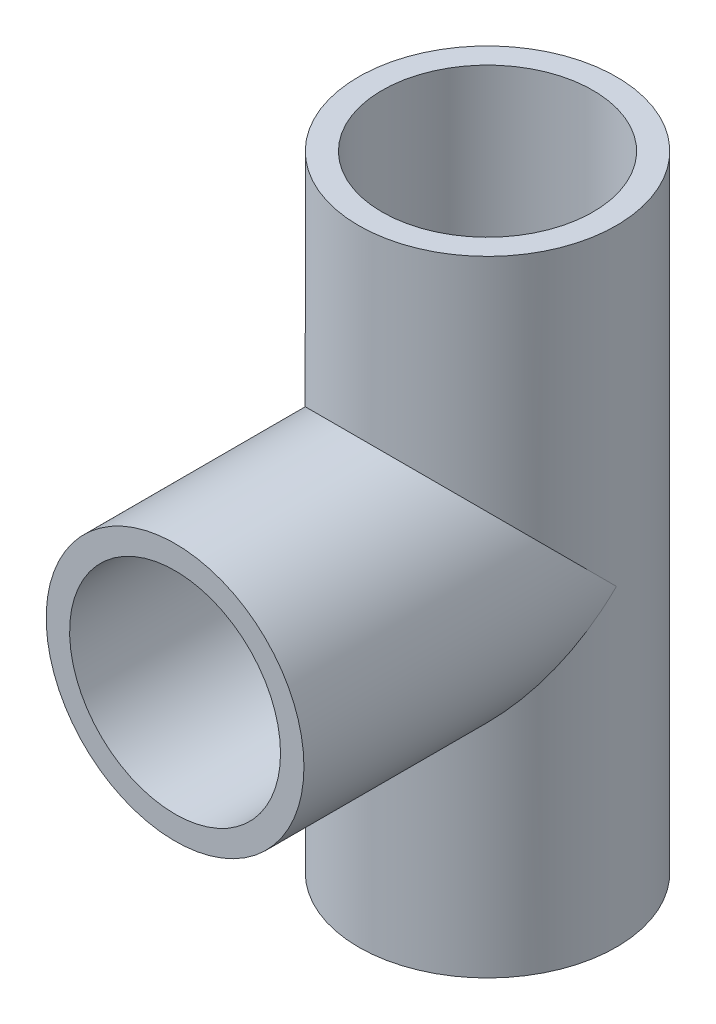
ISO-10303-21;
HEADER;
FILE_DESCRIPTION(('STEP AP214'),'2;1');
FILE_NAME('part.step','',(''),(''),'','','');
FILE_SCHEMA(('AUTOMOTIVE_DESIGN { 1 0 10303 214 1 1 1 1 }'));
ENDSEC;
DATA;
#1=APPLICATION_CONTEXT('core data for automotive mechanical design processes');
#2=APPLICATION_PROTOCOL_DEFINITION('international standard','automotive_design',2000,#1);
#3=PRODUCT_CONTEXT('',#1,'mechanical');
#4=PRODUCT('Part','Part','',(#3));
#5=PRODUCT_RELATED_PRODUCT_CATEGORY('part','',(#4));
#6=PRODUCT_DEFINITION_FORMATION('','',#4);
#7=PRODUCT_DEFINITION_CONTEXT('part definition',#1,'design');
#8=PRODUCT_DEFINITION('design','',#6,#7);
#9=PRODUCT_DEFINITION_SHAPE('','',#8);
#10=(LENGTH_UNIT() NAMED_UNIT(*) SI_UNIT(.MILLI.,.METRE.));
#11=(NAMED_UNIT(*) PLANE_ANGLE_UNIT() SI_UNIT($,.RADIAN.));
#12=(NAMED_UNIT(*) SI_UNIT($,.STERADIAN.) SOLID_ANGLE_UNIT());
#13=UNCERTAINTY_MEASURE_WITH_UNIT(LENGTH_MEASURE(1.E-05),#10,'distance_accuracy_value','');
#14=(GEOMETRIC_REPRESENTATION_CONTEXT(3) GLOBAL_UNCERTAINTY_ASSIGNED_CONTEXT((#13)) GLOBAL_UNIT_ASSIGNED_CONTEXT((#10,
#11,#12)) REPRESENTATION_CONTEXT('',''));
#15=CARTESIAN_POINT('',(0.,0.,0.));
#16=DIRECTION('',(0.,0.,1.));
#17=DIRECTION('',(1.,0.,0.));
#18=AXIS2_PLACEMENT_3D('',#15,#16,#17);
#19=CARTESIAN_POINT('',(0.,0.,0.));
#20=DIRECTION('',(0.,1.,0.));
#21=DIRECTION('',(0.,0.,1.));
#22=AXIS2_PLACEMENT_3D('',#19,#20,#21);
#23=CYLINDRICAL_SURFACE('',#22,16.5);
#24=CARTESIAN_POINT('',(0.,80.,0.));
#25=DIRECTION('',(0.,1.,0.));
#26=DIRECTION('',(0.,0.,1.));
#27=AXIS2_PLACEMENT_3D('',#24,#25,#26);
#28=CIRCLE('',#27,16.5);
#29=CARTESIAN_POINT('',(0.,80.,16.5));
#30=VERTEX_POINT('',#29);
#31=EDGE_CURVE('E109',#30,#30,#28,.T.);
#32=ORIENTED_EDGE('',*,*,#31,.F.);
#33=EDGE_LOOP('',(#32));
#34=FACE_BOUND('',#33,.T.);
#35=CARTESIAN_POINT('',(0.,0.,0.));
#36=DIRECTION('',(0.,1.,0.));
#37=DIRECTION('',(0.,0.,1.));
#38=AXIS2_PLACEMENT_3D('',#35,#36,#37);
#39=CIRCLE('',#38,16.5);
#40=CARTESIAN_POINT('',(0.,0.,16.5));
#41=VERTEX_POINT('',#40);
#42=EDGE_CURVE('E105',#41,#41,#39,.T.);
#43=ORIENTED_EDGE('',*,*,#42,.T.);
#44=EDGE_LOOP('',(#43));
#45=FACE_BOUND('',#44,.T.);
#46=CARTESIAN_POINT('',(0.,40.,0.));
#47=DIRECTION('',(0.,0.707106781186547,0.707106781186547));
#48=DIRECTION('',(0.,0.707106781186547,-0.707106781186547));
#49=AXIS2_PLACEMENT_3D('',#46,#47,#48);
#50=ELLIPSE('',#49,23.3345237791561,16.5);
#51=CARTESIAN_POINT('',(16.5,40.,0.));
#52=VERTEX_POINT('',#51);
#53=CARTESIAN_POINT('',(-16.5,40.,0.));
#54=VERTEX_POINT('',#53);
#55=EDGE_CURVE('E95',#52,#54,#50,.F.);
#56=ORIENTED_EDGE('',*,*,#55,.T.);
#57=CARTESIAN_POINT('',(0.,40.,0.));
#58=DIRECTION('',(0.,0.707106781186547,-0.707106781186547));
#59=DIRECTION('',(0.,0.707106781186547,0.707106781186547));
#60=AXIS2_PLACEMENT_3D('',#57,#58,#59);
#61=ELLIPSE('',#60,23.3345237791561,16.5);
#62=EDGE_CURVE('E99',#54,#52,#61,.T.);
#63=ORIENTED_EDGE('',*,*,#62,.T.);
#64=EDGE_LOOP('',(#56,#63));
#65=FACE_BOUND('',#64,.T.);
#66=ADVANCED_FACE('F45',(#34,#45,#65),#23,.T.);
#67=CARTESIAN_POINT('',(0.,0.,0.));
#68=DIRECTION('',(0.,1.,0.));
#69=DIRECTION('',(0.,0.,1.));
#70=AXIS2_PLACEMENT_3D('',#67,#68,#69);
#71=CYLINDRICAL_SURFACE('',#70,13.5);
#72=CARTESIAN_POINT('',(0.,80.,0.));
#73=DIRECTION('',(0.,1.,0.));
#74=DIRECTION('',(0.,0.,1.));
#75=AXIS2_PLACEMENT_3D('',#72,#73,#74);
#76=CIRCLE('',#75,13.5);
#77=CARTESIAN_POINT('',(0.,80.,13.5));
#78=VERTEX_POINT('',#77);
#79=EDGE_CURVE('E116',#78,#78,#76,.F.);
#80=ORIENTED_EDGE('',*,*,#79,.F.);
#81=EDGE_LOOP('',(#80));
#82=FACE_BOUND('',#81,.T.);
#83=CARTESIAN_POINT('',(0.,0.,0.));
#84=DIRECTION('',(0.,1.,0.));
#85=DIRECTION('',(0.,0.,1.));
#86=AXIS2_PLACEMENT_3D('',#83,#84,#85);
#87=CIRCLE('',#86,13.5);
#88=CARTESIAN_POINT('',(0.,0.,13.5));
#89=VERTEX_POINT('',#88);
#90=EDGE_CURVE('E112',#89,#89,#87,.F.);
#91=ORIENTED_EDGE('',*,*,#90,.T.);
#92=EDGE_LOOP('',(#91));
#93=FACE_BOUND('',#92,.T.);
#94=CARTESIAN_POINT('',(-13.5,30.5131670194949,0.));
#95=CARTESIAN_POINT('',(-13.5000021638284,30.5131746401855,0.124087917367418));
#96=CARTESIAN_POINT('',(-13.4982886251709,30.5107311993952,0.248156159749239));
#97=CARTESIAN_POINT('',(-13.4914546344185,30.5010156213692,0.49599354547566));
#98=CARTESIAN_POINT('',(-13.4863346308635,30.4937441198595,0.619762726045553));
#99=CARTESIAN_POINT('',(-13.4659286508322,30.4648358712868,0.989779249773456));
#100=CARTESIAN_POINT('',(-13.4455964886729,30.4361047778548,1.2352417919871));
#101=CARTESIAN_POINT('',(-13.3923457056594,30.3616854499865,1.71854713230876));
#102=CARTESIAN_POINT('',(-13.35960757638,30.3162406465158,1.95644851285648));
#103=CARTESIAN_POINT('',(-13.2821921746871,30.2103285819099,2.42698690415744));
#104=CARTESIAN_POINT('',(-13.2375086318469,30.1498534321702,2.65962108026433));
#105=CARTESIAN_POINT('',(-13.1179143562329,29.9908247284671,3.20549380356745));
#106=CARTESIAN_POINT('',(-13.0379625937989,29.8865190811439,3.51595347246484));
#107=CARTESIAN_POINT('',(-12.8585429475993,29.659361509393,4.12413820471579));
#108=CARTESIAN_POINT('',(-12.7590677063543,29.5365025971509,4.42185841548867));
#109=CARTESIAN_POINT('',(-12.541198406159,29.2763188251354,5.00663775034015));
#110=CARTESIAN_POINT('',(-12.4226689352299,29.1388930217896,5.29360093557335));
#111=CARTESIAN_POINT('',(-12.1682562472195,28.854598879947,5.85478005327838));
#112=CARTESIAN_POINT('',(-12.0323732108787,28.7077306398028,6.12899611847326));
#113=CARTESIAN_POINT('',(-11.6859105267532,28.3477725151962,6.77286572461673));
#114=CARTESIAN_POINT('',(-11.4672589438307,28.1317913122517,7.13658208013373));
#115=CARTESIAN_POINT('',(-10.9980751412778,27.6957292005709,7.8403590107121));
#116=CARTESIAN_POINT('',(-10.747530539603,27.4756467280501,8.18041031839772));
#117=CARTESIAN_POINT('',(-10.2155206481377,27.0380729378439,8.83577273647615));
#118=CARTESIAN_POINT('',(-9.93411906585938,26.8205772720481,9.15113259942887));
#119=CARTESIAN_POINT('',(-9.34018704695654,26.3932112769,9.75656752342829));
#120=CARTESIAN_POINT('',(-9.02766777569175,26.1833382490894,10.0466515841501));
#121=CARTESIAN_POINT('',(-8.43897428919781,25.8180429244619,10.5427671404784));
#122=CARTESIAN_POINT('',(-8.16848690528565,25.6602795001556,10.7538371295939));
#123=CARTESIAN_POINT('',(-7.60821434899069,25.3553161151326,11.1572490492237));
#124=CARTESIAN_POINT('',(-7.3184299744388,25.2081157182114,11.3495917532061));
#125=CARTESIAN_POINT('',(-6.72046308412562,24.9270306606792,11.7135711228468));
#126=CARTESIAN_POINT('',(-6.41230090821685,24.7931317006967,11.8852300672876));
#127=CARTESIAN_POINT('',(-5.7782984312312,24.5411009394474,12.2060398819899));
#128=CARTESIAN_POINT('',(-5.45246122616052,24.4229663893067,12.3551946769423));
#129=CARTESIAN_POINT('',(-4.84071471750938,24.2233418300785,12.6058586954801));
#130=CARTESIAN_POINT('',(-4.55727760475315,24.1390290566915,12.7111632032669));
#131=CARTESIAN_POINT('',(-3.98050962921239,23.9845503606376,12.9034066576875));
#132=CARTESIAN_POINT('',(-3.68718059941551,23.9143818336516,12.9903489854113));
#133=CARTESIAN_POINT('',(-3.09229769805653,23.7895088951491,13.1446596061456));
#134=CARTESIAN_POINT('',(-2.79074696660165,23.7347986679197,13.2120352607852));
#135=CARTESIAN_POINT('',(-2.18124626322261,23.641907762569,13.3262254833269));
#136=CARTESIAN_POINT('',(-1.87329621640919,23.6037272780046,13.373039810464));
#137=CARTESIAN_POINT('',(-1.25202549694399,23.5446005332162,13.4454680826836));
#138=CARTESIAN_POINT('',(-0.938688512888339,23.5237223623191,13.4709982712051));
#139=CARTESIAN_POINT('',(-0.310310042546883,23.4999224326476,13.5000974167442));
#140=CARTESIAN_POINT('',(0.00473144720533841,23.4970007104047,13.5036663290827));
#141=CARTESIAN_POINT('',(0.633937997369376,23.5091801510815,13.4887789351611));
#142=CARTESIAN_POINT('',(0.948103062465647,23.5242812174845,13.4703227468512));
#143=CARTESIAN_POINT('',(1.57302651897773,23.5721641776739,13.411714111128));
#144=CARTESIAN_POINT('',(1.88378500872794,23.6049455597206,13.3715622916736));
#145=CARTESIAN_POINT('',(2.4806309707964,23.6849301229601,13.2733666193786));
#146=CARTESIAN_POINT('',(2.76706178183255,23.7311243378795,13.2165725637708));
#147=CARTESIAN_POINT('',(3.33313607492585,23.8376008473917,13.0852826200077));
#148=CARTESIAN_POINT('',(3.61277989535328,23.8978824380492,13.010787616352));
#149=CARTESIAN_POINT('',(4.16383656240748,24.0315042769875,12.8450480203875));
#150=CARTESIAN_POINT('',(4.43524945496366,24.1048444523845,12.7538035215626));
#151=CARTESIAN_POINT('',(4.96876816922374,24.2634554266111,12.5555712740481));
#152=CARTESIAN_POINT('',(5.23087052937382,24.3487306057233,12.4485777445356));
#153=CARTESIAN_POINT('',(5.76802683205482,24.5381714440173,12.2095832684624));
#154=CARTESIAN_POINT('',(6.04210642481876,24.6433482449747,12.0761954897331));
#155=CARTESIAN_POINT('',(6.57724695935074,24.86481809099,11.7932812577103));
#156=CARTESIAN_POINT('',(6.83830248949452,24.9811156992671,11.6437481762102));
#157=CARTESIAN_POINT('',(7.34672767465209,25.2231644865942,11.3298218394455));
#158=CARTESIAN_POINT('',(7.59409666055202,25.3489161271293,11.1654278586876));
#159=CARTESIAN_POINT('',(8.07480855409087,25.6082636003897,10.8228737896824));
#160=CARTESIAN_POINT('',(8.30814951238881,25.7418605182227,10.6447117960512));
#161=CARTESIAN_POINT('',(8.80750794825335,26.0436526749939,10.2372885465465));
#162=CARTESIAN_POINT('',(9.07026991788762,26.2132784231182,10.0050913036123));
#163=CARTESIAN_POINT('',(9.57488979509109,26.5588311098509,9.5232987807895));
#164=CARTESIAN_POINT('',(9.81674445300387,26.7347590220256,9.27370080713018));
#165=CARTESIAN_POINT('',(10.2797725693711,27.0902528439051,8.75766086917118));
#166=CARTESIAN_POINT('',(10.5009169364315,27.2698234524062,8.49119606683328));
#167=CARTESIAN_POINT('',(10.922021737061,27.6292263941825,7.94223627678853));
#168=CARTESIAN_POINT('',(11.1219840565196,27.8090587027103,7.65974271960565));
#169=CARTESIAN_POINT('',(11.4929869480973,28.1583968379228,7.09028353243887));
#170=CARTESIAN_POINT('',(11.6648592397781,28.328029590066,6.80393797373973));
#171=CARTESIAN_POINT('',(11.9883966118805,28.6605930575903,6.21618059826845));
#172=CARTESIAN_POINT('',(12.1400578966811,28.8235225101335,5.91476596610367));
#173=CARTESIAN_POINT('',(12.422067321654,29.1378295076585,5.29692458189939));
#174=CARTESIAN_POINT('',(12.5524464377992,29.289223667742,4.98052052871885));
#175=CARTESIAN_POINT('',(12.7907457357203,29.5749628743725,4.33197702023832));
#176=CARTESIAN_POINT('',(12.8986791019794,29.7093179113862,3.99984694387002));
#177=CARTESIAN_POINT('',(13.058119473308,29.9130654214678,3.4337636008607));
#178=CARTESIAN_POINT('',(13.1164252264281,29.9891561509858,3.20412585081757));
#179=CARTESIAN_POINT('',(13.2215025529656,30.1283500342396,2.7383955260649));
#180=CARTESIAN_POINT('',(13.2682784029193,30.1914580019481,2.50230538080533));
#181=CARTESIAN_POINT('',(13.3494163614076,30.302175720113,2.02520232840163));
#182=CARTESIAN_POINT('',(13.3838175231472,30.3498341796795,1.78420748987141));
#183=CARTESIAN_POINT('',(13.4396762550741,30.4277783096888,1.2980289762919));
#184=CARTESIAN_POINT('',(13.4611424849487,30.4580756024302,1.05284821696841));
#185=CARTESIAN_POINT('',(13.4839022336048,30.4902912875641,0.672609323125134));
#186=CARTESIAN_POINT('',(13.4899311165372,30.4988508237527,0.53835772375549));
#187=CARTESIAN_POINT('',(13.4979830042865,30.5102963419857,0.269411695842707));
#188=CARTESIAN_POINT('',(13.5000035638023,30.5131788607245,0.134717047165492));
#189=CARTESIAN_POINT('',(13.5,30.5131670194949,0.));
#190=B_SPLINE_CURVE_WITH_KNOTS('',3,(#94,#95,#96,#97,#98,#99,#100,#101,#102,#103,#104,#105,#106,
#107,#108,#109,#110,#111,#112,#113,#114,#115,#116,#117,#118,#119,#120,#121,#122,#123,#124,#125,
#126,#127,#128,#129,#130,#131,#132,#133,#134,#135,#136,#137,#138,#139,#140,#141,#142,#143,#144,
#145,#146,#147,#148,#149,#150,#151,#152,#153,#154,#155,#156,#157,#158,#159,#160,#161,#162,#163,
#164,#165,#166,#167,#168,#169,#170,#171,#172,#173,#174,#175,#176,#177,#178,#179,#180,#181,#182,
#183,#184,#185,#186,#187,#188,#189),.UNSPECIFIED.,.F.,.F.,(4,2,2,2,2,2,2,2,2,2,2,2,2,2,2,2,2,2,
2,2,2,2,2,2,2,2,2,2,2,2,2,2,2,2,2,2,2,2,2,2,2,2,2,2,2,2,2,4),(0.,0.372189830805686,
0.744330663907449,1.48709990004565,2.21945365262969,2.95219259224372,3.96196551702797,
4.97211971087101,5.98979885313313,7.00746739694256,8.43414619621145,9.86138058375607,
11.2857218841906,12.7095539449042,13.8414392398083,14.9732777661213,16.103886062902,
17.234296954763,18.1750648534042,19.1156593739646,20.055899551955,20.9961507394966,
21.940084733879,22.8840206486429,23.8279515084021,24.7718550484678,25.6578088821317,
26.5437184548226,27.4296230831395,28.3158537053422,29.2822826512501,30.2491098692566,
31.2159843122537,32.1829928034647,33.3504911575775,34.5181706527378,35.6874665090234,
36.8566581723909,37.9795506252575,39.1026536607014,40.2241071676509,41.344900067984,
42.0908461127672,42.8365150622623,43.5798096750926,44.3226061120407,44.7264221870039,
45.1304845366664),.UNSPECIFIED.);
#191=CARTESIAN_POINT('',(-13.5,30.5131670194949,0.));
#192=VERTEX_POINT('',#191);
#193=CARTESIAN_POINT('',(13.5,30.5131670194949,0.));
#194=VERTEX_POINT('',#193);
#195=EDGE_CURVE('E50',#192,#194,#190,.T.);
#196=ORIENTED_EDGE('',*,*,#195,.T.);
#197=DIRECTION('',(0.,1.,0.));
#198=VECTOR('',#197,1.);
#199=CARTESIAN_POINT('',(13.5,0.,0.));
#200=LINE('',#199,#198);
#201=CARTESIAN_POINT('',(13.5,40.,0.));
#202=VERTEX_POINT('',#201);
#203=EDGE_CURVE('E62',#194,#202,#200,.T.);
#204=ORIENTED_EDGE('',*,*,#203,.T.);
#205=CARTESIAN_POINT('',(13.5,49.4868329805051,0.));
#206=VERTEX_POINT('',#205);
#207=EDGE_CURVE('E133',#202,#206,#200,.T.);
#208=ORIENTED_EDGE('',*,*,#207,.T.);
#209=CARTESIAN_POINT('',(13.5,49.4868329805051,0.));
#210=CARTESIAN_POINT('',(13.5000021638284,49.4868253598145,0.124087917367418));
#211=CARTESIAN_POINT('',(13.4982886251709,49.4892688006048,0.248156159749239));
#212=CARTESIAN_POINT('',(13.4914546344185,49.4989843786308,0.495993545475659));
#213=CARTESIAN_POINT('',(13.4863346308635,49.5062558801405,0.619762726045552));
#214=CARTESIAN_POINT('',(13.4659286508322,49.5351641287131,0.989779249773455));
#215=CARTESIAN_POINT('',(13.4455964886729,49.5638952221452,1.2352417919871));
#216=CARTESIAN_POINT('',(13.3923457056594,49.6383145500135,1.71854713230876));
#217=CARTESIAN_POINT('',(13.35960757638,49.6837593534842,1.95644851285647));
#218=CARTESIAN_POINT('',(13.2821921746871,49.7896714180901,2.42698690415743));
#219=CARTESIAN_POINT('',(13.2375086318469,49.8501465678298,2.65962108026433));
#220=CARTESIAN_POINT('',(13.1179143562329,50.0091752715329,3.20549380356745));
#221=CARTESIAN_POINT('',(13.0379625937989,50.1134809188561,3.51595347246484));
#222=CARTESIAN_POINT('',(12.8585429475993,50.340638490607,4.12413820471579));
#223=CARTESIAN_POINT('',(12.7590677063543,50.4634974028491,4.42185841548866));
#224=CARTESIAN_POINT('',(12.541198406159,50.7236811748646,5.00663775034015));
#225=CARTESIAN_POINT('',(12.4226689352299,50.8611069782104,5.29360093557335));
#226=CARTESIAN_POINT('',(12.1682562472195,51.145401120053,5.85478005327838));
#227=CARTESIAN_POINT('',(12.0323732108787,51.2922693601972,6.12899611847326));
#228=CARTESIAN_POINT('',(11.6859105267532,51.6522274848038,6.77286572461672));
#229=CARTESIAN_POINT('',(11.4672589438307,51.8682086877483,7.13658208013373));
#230=CARTESIAN_POINT('',(10.9980751412778,52.304270799429,7.84035901071209));
#231=CARTESIAN_POINT('',(10.747530539603,52.5243532719499,8.18041031839772));
#232=CARTESIAN_POINT('',(10.2155206481377,52.9619270621561,8.83577273647614));
#233=CARTESIAN_POINT('',(9.93411906585938,53.1794227279519,9.15113259942886));
#234=CARTESIAN_POINT('',(9.34018704695654,53.6067887231,9.75656752342828));
#235=CARTESIAN_POINT('',(9.02766777569176,53.8166617509106,10.0466515841501));
#236=CARTESIAN_POINT('',(8.43897428919782,54.1819570755381,10.5427671404784));
#237=CARTESIAN_POINT('',(8.16848690528566,54.3397204998444,10.7538371295939));
#238=CARTESIAN_POINT('',(7.60821434899069,54.6446838848674,11.1572490492237));
#239=CARTESIAN_POINT('',(7.3184299744388,54.7918842817886,11.3495917532061));
#240=CARTESIAN_POINT('',(6.72046308412563,55.0729693393208,11.7135711228468));
#241=CARTESIAN_POINT('',(6.41230090821686,55.2068682993033,11.8852300672876));
#242=CARTESIAN_POINT('',(5.77829843123121,55.4588990605526,12.2060398819899));
#243=CARTESIAN_POINT('',(5.45246122616053,55.5770336106933,12.3551946769423));
#244=CARTESIAN_POINT('',(4.84071471750939,55.7766581699215,12.6058586954801));
#245=CARTESIAN_POINT('',(4.55727760475316,55.8609709433085,12.7111632032669));
#246=CARTESIAN_POINT('',(3.9805096292124,56.0154496393624,12.9034066576875));
#247=CARTESIAN_POINT('',(3.68718059941552,56.0856181663484,12.9903489854113));
#248=CARTESIAN_POINT('',(3.09229769805654,56.2104911048509,13.1446596061456));
#249=CARTESIAN_POINT('',(2.79074696660166,56.2652013320803,13.2120352607851));
#250=CARTESIAN_POINT('',(2.18124626322262,56.358092237431,13.3262254833269));
#251=CARTESIAN_POINT('',(1.8732962164092,56.3962727219954,13.373039810464));
#252=CARTESIAN_POINT('',(1.252025496944,56.4553994667838,13.4454680826836));
#253=CARTESIAN_POINT('',(0.938688512888346,56.4762776376809,13.4709982712051));
#254=CARTESIAN_POINT('',(0.310310042546889,56.5000775673524,13.5000974167442));
#255=CARTESIAN_POINT('',(-0.00473144720533348,56.5029992895953,13.5036663290827));
#256=CARTESIAN_POINT('',(-0.633937997369372,56.4908198489185,13.4887789351611));
#257=CARTESIAN_POINT('',(-0.948103062465643,56.4757187825155,13.4703227468512));
#258=CARTESIAN_POINT('',(-1.57302651897773,56.4278358223262,13.411714111128));
#259=CARTESIAN_POINT('',(-1.88378500872794,56.3950544402794,13.3715622916736));
#260=CARTESIAN_POINT('',(-2.4806309707964,56.3150698770399,13.2733666193786));
#261=CARTESIAN_POINT('',(-2.76706178183254,56.2688756621205,13.2165725637708));
#262=CARTESIAN_POINT('',(-3.33313607492585,56.1623991526083,13.0852826200077));
#263=CARTESIAN_POINT('',(-3.61277989535327,56.1021175619508,13.010787616352));
#264=CARTESIAN_POINT('',(-4.16383656240748,55.9684957230125,12.8450480203875));
#265=CARTESIAN_POINT('',(-4.43524945496366,55.8951555476155,12.7538035215626));
#266=CARTESIAN_POINT('',(-4.96876816922373,55.7365445733889,12.5555712740481));
#267=CARTESIAN_POINT('',(-5.23087052937381,55.6512693942767,12.4485777445356));
#268=CARTESIAN_POINT('',(-5.76802683205482,55.4618285559827,12.2095832684624));
#269=CARTESIAN_POINT('',(-6.04210642481876,55.3566517550253,12.0761954897331));
#270=CARTESIAN_POINT('',(-6.57724695935074,55.13518190901,11.7932812577103));
#271=CARTESIAN_POINT('',(-6.83830248949451,55.0188843007329,11.6437481762102));
#272=CARTESIAN_POINT('',(-7.34672767465209,54.7768355134058,11.3298218394455));
#273=CARTESIAN_POINT('',(-7.59409666055202,54.6510838728707,11.1654278586876));
#274=CARTESIAN_POINT('',(-8.07480855409087,54.3917363996103,10.8228737896824));
#275=CARTESIAN_POINT('',(-8.3081495123888,54.2581394817773,10.6447117960512));
#276=CARTESIAN_POINT('',(-8.80750794825334,53.9563473250061,10.2372885465465));
#277=CARTESIAN_POINT('',(-9.07026991788761,53.7867215768818,10.0050913036123));
#278=CARTESIAN_POINT('',(-9.57488979509109,53.4411688901491,9.5232987807895));
#279=CARTESIAN_POINT('',(-9.81674445300387,53.2652409779744,9.27370080713018));
#280=CARTESIAN_POINT('',(-10.2797725693711,52.9097471560949,8.75766086917118));
#281=CARTESIAN_POINT('',(-10.5009169364315,52.7301765475938,8.49119606683328));
#282=CARTESIAN_POINT('',(-10.922021737061,52.3707736058175,7.94223627678853));
#283=CARTESIAN_POINT('',(-11.1219840565196,52.1909412972897,7.65974271960565));
#284=CARTESIAN_POINT('',(-11.4929869480973,51.8416031620772,7.09028353243887));
#285=CARTESIAN_POINT('',(-11.664859239778,51.671970409934,6.80393797373973));
#286=CARTESIAN_POINT('',(-11.9883966118805,51.3394069424097,6.21618059826845));
#287=CARTESIAN_POINT('',(-12.1400578966811,51.1764774898665,5.91476596610367));
#288=CARTESIAN_POINT('',(-12.422067321654,50.8621704923415,5.29692458189939));
#289=CARTESIAN_POINT('',(-12.5524464377992,50.710776332258,4.98052052871885));
#290=CARTESIAN_POINT('',(-12.7907457357203,50.4250371256275,4.33197702023832));
#291=CARTESIAN_POINT('',(-12.8986791019794,50.2906820886138,3.99984694387002));
#292=CARTESIAN_POINT('',(-13.058119473308,50.0869345785322,3.4337636008607));
#293=CARTESIAN_POINT('',(-13.1164252264281,50.0108438490142,3.20412585081757));
#294=CARTESIAN_POINT('',(-13.2215025529656,49.8716499657604,2.7383955260649));
#295=CARTESIAN_POINT('',(-13.2682784029193,49.8085419980519,2.50230538080533));
#296=CARTESIAN_POINT('',(-13.3494163614076,49.697824279887,2.02520232840163));
#297=CARTESIAN_POINT('',(-13.3838175231472,49.6501658203206,1.78420748987141));
#298=CARTESIAN_POINT('',(-13.4396762550741,49.5722216903112,1.2980289762919));
#299=CARTESIAN_POINT('',(-13.4611424849487,49.5419243975698,1.05284821696842));
#300=CARTESIAN_POINT('',(-13.4839022336048,49.5097087124359,0.672609323125136));
#301=CARTESIAN_POINT('',(-13.4899311165372,49.5011491762473,0.538357723755492));
#302=CARTESIAN_POINT('',(-13.4979830042865,49.4897036580143,0.269411695842708));
#303=CARTESIAN_POINT('',(-13.5000035638023,49.4868211392755,0.134717047165492));
#304=CARTESIAN_POINT('',(-13.5,49.4868329805051,0.));
#305=B_SPLINE_CURVE_WITH_KNOTS('',3,(#209,#210,#211,#212,#213,#214,#215,#216,#217,#218,#219,
#220,#221,#222,#223,#224,#225,#226,#227,#228,#229,#230,#231,#232,#233,#234,#235,#236,#237,#238,
#239,#240,#241,#242,#243,#244,#245,#246,#247,#248,#249,#250,#251,#252,#253,#254,#255,#256,#257,
#258,#259,#260,#261,#262,#263,#264,#265,#266,#267,#268,#269,#270,#271,#272,#273,#274,#275,#276,
#277,#278,#279,#280,#281,#282,#283,#284,#285,#286,#287,#288,#289,#290,#291,#292,#293,#294,#295,
#296,#297,#298,#299,#300,#301,#302,#303,#304),.UNSPECIFIED.,.F.,.F.,(4,2,2,2,2,2,2,2,2,2,2,2,2,
2,2,2,2,2,2,2,2,2,2,2,2,2,2,2,2,2,2,2,2,2,2,2,2,2,2,2,2,2,2,2,2,2,2,4),(0.,0.372189830805685,
0.744330663907447,1.48709990004565,2.21945365262969,2.95219259224372,3.96196551702797,
4.97211971087101,5.98979885313313,7.00746739694256,8.43414619621144,9.86138058375606,
11.2857218841906,12.7095539449042,13.8414392398083,14.9732777661213,16.103886062902,
17.234296954763,18.1750648534042,19.1156593739646,20.055899551955,20.9961507394966,
21.940084733879,22.8840206486429,23.8279515084021,24.7718550484678,25.6578088821317,
26.5437184548226,27.4296230831395,28.3158537053422,29.2822826512501,30.2491098692566,
31.2159843122537,32.1829928034647,33.3504911575775,34.5181706527378,35.6874665090234,
36.8566581723909,37.9795506252575,39.1026536607014,40.2241071676509,41.344900067984,
42.0908461127672,42.8365150622623,43.5798096750926,44.3226061120407,44.7264221870039,
45.1304845366664),.UNSPECIFIED.);
#306=CARTESIAN_POINT('',(-13.5,49.4868329805051,0.));
#307=VERTEX_POINT('',#306);
#308=EDGE_CURVE('E136',#206,#307,#305,.T.);
#309=ORIENTED_EDGE('',*,*,#308,.T.);
#310=DIRECTION('',(0.,1.,0.));
#311=VECTOR('',#310,1.);
#312=CARTESIAN_POINT('',(-13.5,0.,0.));
#313=LINE('',#312,#311);
#314=CARTESIAN_POINT('',(-13.5,40.,0.));
#315=VERTEX_POINT('',#314);
#316=EDGE_CURVE('E134',#307,#315,#313,.F.);
#317=ORIENTED_EDGE('',*,*,#316,.T.);
#318=EDGE_CURVE('E130',#315,#192,#313,.F.);
#319=ORIENTED_EDGE('',*,*,#318,.T.);
#320=EDGE_LOOP('',(#196,#204,#208,#309,#317,#319));
#321=FACE_BOUND('',#320,.T.);
#322=ADVANCED_FACE('F198',(#82,#93,#321),#71,.F.);
#323=CARTESIAN_POINT('',(0.,0.,0.));
#324=DIRECTION('',(0.,1.,0.));
#325=DIRECTION('',(0.,0.,1.));
#326=AXIS2_PLACEMENT_3D('',#323,#324,#325);
#327=PLANE('',#326);
#328=ORIENTED_EDGE('',*,*,#90,.F.);
#329=EDGE_LOOP('',(#328));
#330=FACE_BOUND('',#329,.T.);
#331=ORIENTED_EDGE('',*,*,#42,.F.);
#332=EDGE_LOOP('',(#331));
#333=FACE_BOUND('',#332,.T.);
#334=ADVANCED_FACE('F167',(#330,#333),#327,.F.);
#335=CARTESIAN_POINT('',(0.,80.,0.));
#336=DIRECTION('',(0.,1.,0.));
#337=DIRECTION('',(0.,0.,1.));
#338=AXIS2_PLACEMENT_3D('',#335,#336,#337);
#339=PLANE('',#338);
#340=ORIENTED_EDGE('',*,*,#79,.T.);
#341=EDGE_LOOP('',(#340));
#342=FACE_BOUND('',#341,.T.);
#343=ORIENTED_EDGE('',*,*,#31,.T.);
#344=EDGE_LOOP('',(#343));
#345=FACE_BOUND('',#344,.T.);
#346=ADVANCED_FACE('F166',(#342,#345),#339,.T.);
#347=CARTESIAN_POINT('',(0.,40.,40.));
#348=DIRECTION('',(0.,0.,-1.));
#349=DIRECTION('',(-1.,0.,0.));
#350=AXIS2_PLACEMENT_3D('',#347,#348,#349);
#351=CYLINDRICAL_SURFACE('',#350,13.5);
#352=CARTESIAN_POINT('',(0.,40.,0.));
#353=DIRECTION('',(0.,0.,1.));
#354=DIRECTION('',(1.,0.,0.));
#355=AXIS2_PLACEMENT_3D('',#352,#353,#354);
#356=CIRCLE('',#355,13.5);
#357=EDGE_CURVE('E76',#315,#202,#356,.T.);
#358=ORIENTED_EDGE('',*,*,#357,.F.);
#359=CARTESIAN_POINT('',(0.,40.,0.));
#360=DIRECTION('',(0.,0.707106781186547,0.707106781186547));
#361=DIRECTION('',(0.,0.707106781186547,-0.707106781186547));
#362=AXIS2_PLACEMENT_3D('',#359,#360,#361);
#363=ELLIPSE('',#362,19.0918830920368,13.5);
#364=EDGE_CURVE('E120',#315,#202,#363,.T.);
#365=ORIENTED_EDGE('',*,*,#364,.T.);
#366=EDGE_LOOP('',(#358,#365));
#367=FACE_BOUND('',#366,.T.);
#368=ADVANCED_FACE('F163',(#367),#351,.F.);
#369=CARTESIAN_POINT('',(0.,40.,40.));
#370=DIRECTION('',(0.,0.,-1.));
#371=DIRECTION('',(-1.,0.,0.));
#372=AXIS2_PLACEMENT_3D('',#369,#370,#371);
#373=CYLINDRICAL_SURFACE('',#372,16.5);
#374=ORIENTED_EDGE('',*,*,#195,.F.);
#375=CARTESIAN_POINT('',(0.,40.,0.));
#376=DIRECTION('',(0.,0.,1.));
#377=DIRECTION('',(1.,0.,0.));
#378=AXIS2_PLACEMENT_3D('',#375,#376,#377);
#379=CIRCLE('',#378,16.5);
#380=EDGE_CURVE('E172',#192,#194,#379,.T.);
#381=ORIENTED_EDGE('',*,*,#380,.T.);
#382=EDGE_LOOP('',(#374,#381));
#383=FACE_BOUND('',#382,.T.);
#384=ADVANCED_FACE('F151',(#383),#373,.T.);
#385=CARTESIAN_POINT('',(0.,40.,0.));
#386=DIRECTION('',(0.,0.,1.));
#387=DIRECTION('',(1.,0.,0.));
#388=AXIS2_PLACEMENT_3D('',#385,#386,#387);
#389=PLANE('',#388);
#390=ORIENTED_EDGE('',*,*,#203,.F.);
#391=ORIENTED_EDGE('',*,*,#380,.F.);
#392=ORIENTED_EDGE('',*,*,#318,.F.);
#393=ORIENTED_EDGE('',*,*,#357,.T.);
#394=EDGE_LOOP('',(#390,#391,#392,#393));
#395=FACE_BOUND('',#394,.T.);
#396=ADVANCED_FACE('F157',(#395),#389,.F.);
#397=CARTESIAN_POINT('',(0.,40.,0.));
#398=DIRECTION('',(0.,0.707106781186547,-0.707106781186547));
#399=DIRECTION('',(0.,0.707106781186547,0.707106781186547));
#400=AXIS2_PLACEMENT_3D('',#397,#398,#399);
#401=ELLIPSE('',#400,19.0918830920368,13.5);
#402=EDGE_CURVE('E126',#202,#315,#401,.F.);
#403=ORIENTED_EDGE('',*,*,#402,.F.);
#404=ORIENTED_EDGE('',*,*,#364,.F.);
#405=EDGE_LOOP('',(#403,#404));
#406=FACE_BOUND('',#405,.T.);
#407=ADVANCED_FACE('F142',(#406),#71,.F.);
#408=ORIENTED_EDGE('',*,*,#308,.F.);
#409=EDGE_CURVE('E176',#206,#307,#379,.T.);
#410=ORIENTED_EDGE('',*,*,#409,.T.);
#411=EDGE_LOOP('',(#408,#410));
#412=FACE_BOUND('',#411,.T.);
#413=ADVANCED_FACE('F145',(#412),#373,.T.);
#414=EDGE_CURVE('E181',#202,#315,#356,.T.);
#415=ORIENTED_EDGE('',*,*,#414,.F.);
#416=ORIENTED_EDGE('',*,*,#402,.T.);
#417=EDGE_LOOP('',(#415,#416));
#418=FACE_BOUND('',#417,.T.);
#419=ADVANCED_FACE('F149',(#418),#351,.F.);
#420=ORIENTED_EDGE('',*,*,#207,.F.);
#421=ORIENTED_EDGE('',*,*,#414,.T.);
#422=ORIENTED_EDGE('',*,*,#316,.F.);
#423=ORIENTED_EDGE('',*,*,#409,.F.);
#424=EDGE_LOOP('',(#420,#421,#422,#423));
#425=FACE_BOUND('',#424,.T.);
#426=ADVANCED_FACE('F152',(#425),#389,.F.);
#427=ORIENTED_EDGE('',*,*,#62,.F.);
#428=ORIENTED_EDGE('',*,*,#55,.F.);
#429=EDGE_LOOP('',(#427,#428));
#430=FACE_BOUND('',#429,.T.);
#431=CARTESIAN_POINT('',(0.,40.,40.));
#432=DIRECTION('',(0.,0.,1.));
#433=DIRECTION('',(1.,0.,0.));
#434=AXIS2_PLACEMENT_3D('',#431,#432,#433);
#435=CIRCLE('',#434,16.5);
#436=CARTESIAN_POINT('',(16.5,40.,40.));
#437=VERTEX_POINT('',#436);
#438=EDGE_CURVE('E102',#437,#437,#435,.T.);
#439=ORIENTED_EDGE('',*,*,#438,.F.);
#440=EDGE_LOOP('',(#439));
#441=FACE_BOUND('',#440,.T.);
#442=ADVANCED_FACE('F97',(#430,#441),#373,.T.);
#443=CARTESIAN_POINT('',(0.,26.5,16.5));
#444=CARTESIAN_POINT('',(-0.322137405298703,26.5000018559313,16.4999981857799));
#445=CARTESIAN_POINT('',(-0.644304929519497,26.5115503032647,16.4905456710231));
#446=CARTESIAN_POINT('',(-1.28603387161959,26.5575419481087,16.4529482567365));
#447=CARTESIAN_POINT('',(-1.6055939480376,26.5919962603247,16.4247942826276));
#448=CARTESIAN_POINT('',(-2.23993485078914,26.6832603623407,16.3503778539733));
#449=CARTESIAN_POINT('',(-2.55470625533269,26.7401094680176,16.304083553374));
#450=CARTESIAN_POINT('',(-3.17653185252034,26.8751807600559,16.1944227161219));
#451=CARTESIAN_POINT('',(-3.48358681178679,26.9534008139916,16.1310578828014));
#452=CARTESIAN_POINT('',(-4.08610468869648,27.1294277638281,15.9890257783106));
#453=CARTESIAN_POINT('',(-4.38162964491563,27.2271049512279,15.9104599373105));
#454=CARTESIAN_POINT('',(-4.96163447863255,27.4410294341357,15.7392385686471));
#455=CARTESIAN_POINT('',(-5.24611432063776,27.5572767893112,15.6465829957123));
#456=CARTESIAN_POINT('',(-5.80281852848309,27.8069548463472,15.4487716885914));
#457=CARTESIAN_POINT('',(-6.07504536551632,27.940382062217,15.343618490649));
#458=CARTESIAN_POINT('',(-6.60651946898896,28.2231351149629,15.1223939390182));
#459=CARTESIAN_POINT('',(-6.8657640069955,28.3724642734344,15.0063203048631));
#460=CARTESIAN_POINT('',(-7.46137578742272,28.7420721884281,14.7214971868291));
#461=CARTESIAN_POINT('',(-7.79201331825659,28.9685744734181,14.5487981843906));
#462=CARTESIAN_POINT('',(-8.42747020888247,29.4460519096869,14.190171076317));
#463=CARTESIAN_POINT('',(-8.73228096035575,29.6970351612173,14.0042385975334));
#464=CARTESIAN_POINT('',(-9.31645607535724,30.222051201484,13.6226159488179));
#465=CARTESIAN_POINT('',(-9.59575176504798,30.4961425863957,13.426901518648));
#466=CARTESIAN_POINT('',(-10.12783917489,31.0653119061484,13.0302328773096));
#467=CARTESIAN_POINT('',(-10.3806340963739,31.3603872988449,12.8292793027083));
#468=CARTESIAN_POINT('',(-10.8637530387456,31.9759978297547,12.4229689703065));
#469=CARTESIAN_POINT('',(-11.0936175248574,32.2968827187988,12.2175957873926));
#470=CARTESIAN_POINT('',(-11.5255610789639,32.9595505714265,11.8109863459469));
#471=CARTESIAN_POINT('',(-11.7276309879677,33.3013403703438,11.6097514695779));
#472=CARTESIAN_POINT('',(-12.1025542608818,34.0052648216187,11.2183512031701));
#473=CARTESIAN_POINT('',(-12.2754815922713,34.3673447610702,11.0281586169091));
#474=CARTESIAN_POINT('',(-12.5910261766779,35.1133020419184,10.6664672513735));
#475=CARTESIAN_POINT('',(-12.7336695276203,35.4971602508484,10.4949524386966));
#476=CARTESIAN_POINT('',(-12.9303973378702,36.1130212080574,10.2502491543481));
#477=CARTESIAN_POINT('',(-12.9958184511022,36.337457522771,10.167021575558));
#478=CARTESIAN_POINT('',(-13.1157052412933,36.7931661983749,10.0118864837505));
#479=CARTESIAN_POINT('',(-13.1701695341117,37.0244394187227,9.93998040119116));
#480=CARTESIAN_POINT('',(-13.2672874918559,37.492781513867,9.80997823113285));
#481=CARTESIAN_POINT('',(-13.3099649350719,37.7298376546484,9.75185437398507));
#482=CARTESIAN_POINT('',(-13.3828763748756,38.2091005578603,9.65155313216973));
#483=CARTESIAN_POINT('',(-13.413116795661,38.4513045930373,9.60936751570989));
#484=CARTESIAN_POINT('',(-13.4607736677785,38.9421616564007,9.54249954798148));
#485=CARTESIAN_POINT('',(-13.478044655098,39.1908563776568,9.51801584992607));
#486=CARTESIAN_POINT('',(-13.4987502459349,39.6899756860257,9.48862869868158));
#487=CARTESIAN_POINT('',(-13.5021858204876,39.9404001505011,9.48372387135391));
#488=CARTESIAN_POINT('',(-13.4951237628758,40.4407497815398,9.49377004269708));
#489=CARTESIAN_POINT('',(-13.4846204765308,40.6906747042739,9.50872909898474));
#490=CARTESIAN_POINT('',(-13.449962304972,41.1876890505344,9.55768772372261));
#491=CARTESIAN_POINT('',(-13.4258055926424,41.4347780900436,9.5916898405297));
#492=CARTESIAN_POINT('',(-13.3607446517925,41.9536734366041,9.68214641488135));
#493=CARTESIAN_POINT('',(-13.3181772689574,42.2248835945379,9.74080723134431));
#494=CARTESIAN_POINT('',(-13.2177276882821,42.7596673505229,9.87667854276626));
#495=CARTESIAN_POINT('',(-13.1598426069233,43.0232395003622,9.9538925300614));
#496=CARTESIAN_POINT('',(-13.0296910888406,43.5424535576759,10.1236652088585));
#497=CARTESIAN_POINT('',(-12.9573889316408,43.7980739076203,10.2162619163275));
#498=CARTESIAN_POINT('',(-12.79943769761,44.3004371906265,10.4134710438506));
#499=CARTESIAN_POINT('',(-12.7137836093732,44.5471767474672,10.5180879715849));
#500=CARTESIAN_POINT('',(-12.4797119922881,45.1640461813848,10.7960798707033));
#501=CARTESIAN_POINT('',(-12.3225559441467,45.5280116912502,10.9758154575779));
#502=CARTESIAN_POINT('',(-11.9801629243665,46.2354000447551,11.3485626014283));
#503=CARTESIAN_POINT('',(-11.7949111125247,46.5788118974498,11.5415811448643));
#504=CARTESIAN_POINT('',(-11.3971868605923,47.2460422336109,11.9345043845463));
#505=CARTESIAN_POINT('',(-11.1846798667283,47.5698350635243,12.1344175823838));
#506=CARTESIAN_POINT('',(-10.7332024178589,48.1974232959566,12.535532481895));
#507=CARTESIAN_POINT('',(-10.4942368266554,48.5012223575508,12.7367339403658));
#508=CARTESIAN_POINT('',(-9.98014287462606,49.099914061262,13.1437593837925));
#509=CARTESIAN_POINT('',(-9.70396633576226,49.3939948580279,13.3494567986937));
#510=CARTESIAN_POINT('',(-9.12326612918153,49.9589201085682,13.7528552378942));
#511=CARTESIAN_POINT('',(-8.81873819131716,50.2297610502275,13.9505550511809));
#512=CARTESIAN_POINT('',(-8.18227641768607,50.7455936091691,14.3331063598018));
#513=CARTESIAN_POINT('',(-7.85040171293251,50.9906385186064,14.5179840634587));
#514=CARTESIAN_POINT('',(-7.15938595947616,51.452763053913,14.8708960467226));
#515=CARTESIAN_POINT('',(-6.8002559647975,51.6698539218821,15.0389370913511));
#516=CARTESIAN_POINT('',(-6.15685707703319,52.0182510216742,15.3111062891803));
#517=CARTESIAN_POINT('',(-5.87863454911434,52.1568724541428,15.4202230535926));
#518=CARTESIAN_POINT('',(-5.30929856814279,52.4160832611869,15.6253910100835));
#519=CARTESIAN_POINT('',(-5.0181882930604,52.5366770494234,15.7214453996675));
#520=CARTESIAN_POINT('',(-4.42438759123007,52.7583374930715,15.8987658693414));
#521=CARTESIAN_POINT('',(-4.12170229932642,52.8594126895384,15.9800384168437));
#522=CARTESIAN_POINT('',(-3.50625366888651,53.0406700853596,16.1262582825042));
#523=CARTESIAN_POINT('',(-3.19349011741412,53.1208518429462,16.1912052554758));
#524=CARTESIAN_POINT('',(-2.55788521273931,53.2594757909113,16.3037433669835));
#525=CARTESIAN_POINT('',(-2.23499142975609,53.3177727615537,16.3512185292748));
#526=CARTESIAN_POINT('',(-1.58359684315764,53.4108333300875,16.4271033253012));
#527=CARTESIAN_POINT('',(-1.25509604038667,53.4455969315224,16.455512961907));
#528=CARTESIAN_POINT('',(-0.595414454133803,53.490913810544,16.4925615035171));
#529=CARTESIAN_POINT('',(-0.26423453021228,53.5014745664791,16.5012065155182));
#530=CARTESIAN_POINT('',(0.397907804616143,53.498194532583,16.4985227479038));
#531=CARTESIAN_POINT('',(0.728870230372064,53.4843556310061,16.4871955139116));
#532=CARTESIAN_POINT('',(1.35433463494431,53.4351792863735,16.4470018534158));
#533=CARTESIAN_POINT('',(1.64914479626164,53.4021529069562,16.4200212431624));
#534=CARTESIAN_POINT('',(2.23415634756876,53.3171280008094,16.3506969703319));
#535=CARTESIAN_POINT('',(2.52435810918735,53.2651310120914,16.30835455319));
#536=CARTESIAN_POINT('',(3.09837132641127,53.1429153697993,16.2091009701053));
#537=CARTESIAN_POINT('',(3.38218213017908,53.0726948666076,16.1521883253476));
#538=CARTESIAN_POINT('',(3.94183722061654,52.9149702949795,16.0248025307115));
#539=CARTESIAN_POINT('',(4.21768106552006,52.8274652702213,15.9543286305184));
#540=CARTESIAN_POINT('',(4.77039720539248,52.6325930199744,15.7980659777738));
#541=CARTESIAN_POINT('',(5.04691223636475,52.5245986985942,15.711798013006));
#542=CARTESIAN_POINT('',(5.58885442817615,52.2923404248645,15.5272875603168));
#543=CARTESIAN_POINT('',(5.85428163211334,52.1680765357621,15.4290451189456));
#544=CARTESIAN_POINT('',(6.37326104976856,51.9044638369531,15.2220103279799));
#545=CARTESIAN_POINT('',(6.62681258580346,51.7651141678777,15.1132173774074));
#546=CARTESIAN_POINT('',(7.12149474876503,51.4724426194717,14.886516712212));
#547=CARTESIAN_POINT('',(7.36262291394989,51.3191179874854,14.7686072025927));
#548=CARTESIAN_POINT('',(7.93811699665376,50.9273154793228,14.4700928291289));
#549=CARTESIAN_POINT('',(8.26541287705877,50.6816517778231,14.2852214791777));
#550=CARTESIAN_POINT('',(8.89246070048407,50.1655872332577,13.903559522569));
#551=CARTESIAN_POINT('',(9.19220194282874,49.8951768606406,13.7067643341717));
#552=CARTESIAN_POINT('',(9.76492272821987,49.3305201751133,13.3048521602885));
#553=CARTESIAN_POINT('',(10.0377981628341,49.0361886282946,13.0997068448369));
#554=CARTESIAN_POINT('',(10.5553590924758,48.4258236914212,12.6863722342922));
#555=CARTESIAN_POINT('',(10.8000488671439,48.10979360768,12.4781834067425));
#556=CARTESIAN_POINT('',(11.2649315461091,47.4509482109348,12.060289748867));
#557=CARTESIAN_POINT('',(11.4846434985431,47.107771932879,11.8506182664008));
#558=CARTESIAN_POINT('',(11.8941594057897,46.398951385273,11.4395422037143));
#559=CARTESIAN_POINT('',(12.0839489297915,46.0332963922568,11.2381416467618));
#560=CARTESIAN_POINT('',(12.4312341691592,45.2806684572836,10.8527116528913));
#561=CARTESIAN_POINT('',(12.588877910533,44.8938041421393,10.6686047986911));
#562=CARTESIAN_POINT('',(12.870315771567,44.0967163182166,10.3273342639633));
#563=CARTESIAN_POINT('',(12.9941549365666,43.6865247834523,10.1701348339733));
#564=CARTESIAN_POINT('',(13.1537433530553,43.0462993096861,9.96178461633989));
#565=CARTESIAN_POINT('',(13.2032296841533,42.8243916605334,9.8959689425885));
#566=CARTESIAN_POINT('',(13.2914114098345,42.3750307412683,9.77721059987736));
#567=CARTESIAN_POINT('',(13.3301086189672,42.1475784106842,9.72426576645006));
#568=CARTESIAN_POINT('',(13.3959854967,41.6885516210265,9.63331396996415));
#569=CARTESIAN_POINT('',(13.4231898934453,41.4569871408073,9.5952749482063));
#570=CARTESIAN_POINT('',(13.4656392554033,40.9906376271781,9.53561282607227));
#571=CARTESIAN_POINT('',(13.4808843626009,40.7558526320367,9.51398953080276));
#572=CARTESIAN_POINT('',(13.4991040825026,40.2834862037223,9.48812149959798));
#573=CARTESIAN_POINT('',(13.5020079665337,40.045896456337,9.48397693690641));
#574=CARTESIAN_POINT('',(13.4952777443993,39.5712664475791,9.49355094050203));
#575=CARTESIAN_POINT('',(13.4856438509511,39.3342261769524,9.50726920372661));
#576=CARTESIAN_POINT('',(13.4540558444035,38.8622826366956,9.55191704055625));
#577=CARTESIAN_POINT('',(13.4320842558666,38.6273828796096,9.58287102677196));
#578=CARTESIAN_POINT('',(13.3763042874157,38.1616509536548,9.66057730563972));
#579=CARTESIAN_POINT('',(13.3424940234917,37.9308194383518,9.70733211279748));
#580=CARTESIAN_POINT('',(13.2522982577341,37.4085500929416,9.83025704496465));
#581=CARTESIAN_POINT('',(13.1922142422446,37.118831976724,9.91102171233957));
#582=CARTESIAN_POINT('',(13.0548634592841,36.5494295382937,10.0912509613043));
#583=CARTESIAN_POINT('',(12.9775873289835,36.2697507802726,10.1907257278382));
#584=CARTESIAN_POINT('',(12.8069332925129,35.7203492922574,10.4043828261617));
#585=CARTESIAN_POINT('',(12.7135163640238,35.4506526598281,10.5186006276874));
#586=CARTESIAN_POINT('',(12.5117275236715,34.9219348732609,10.757843408348));
#587=CARTESIAN_POINT('',(12.4033551506221,34.6629140486565,10.8828687207133));
#588=CARTESIAN_POINT('',(12.1138532521521,34.026625070049,11.205908394281));
#589=CARTESIAN_POINT('',(11.9236785208651,33.6559307756676,11.4088113477174));
#590=CARTESIAN_POINT('',(11.5125487719446,32.9372332701219,11.8235637013891));
#591=CARTESIAN_POINT('',(11.2915797769836,32.5892404689223,12.0354171335919));
#592=CARTESIAN_POINT('',(10.8193631911233,31.9153988979125,12.4616480215246));
#593=CARTESIAN_POINT('',(10.5680840265316,31.5895737820135,12.676027895639));
#594=CARTESIAN_POINT('',(10.0357544733264,30.96101823122,13.1015173536221));
#595=CARTESIAN_POINT('',(9.7547093057565,30.6582837621302,13.3126275035882));
#596=CARTESIAN_POINT('',(9.15793192603612,30.0722572589002,13.7301541374449));
#597=CARTESIAN_POINT('',(8.84169589620956,29.789377767936,13.9364319983228));
#598=CARTESIAN_POINT('',(8.17868155648937,29.2509764489873,14.3355815730119));
#599=CARTESIAN_POINT('',(7.83189772399008,28.995459586351,14.5284508514202));
#600=CARTESIAN_POINT('',(7.1095069214219,28.515555809826,14.8952543576798));
#601=CARTESIAN_POINT('',(6.73397703707688,28.2910898787288,15.0692363965128));
#602=CARTESIAN_POINT('',(5.95499944616183,27.8763719402113,15.3936898605919));
#603=CARTESIAN_POINT('',(5.5515699120476,27.6860979471685,15.5441763853709));
#604=CARTESIAN_POINT('',(4.86023322221512,27.4017095376016,15.7706137244925));
#605=CARTESIAN_POINT('',(4.57932302668411,27.2968213798968,15.8545733562104));
#606=CARTESIAN_POINT('',(4.0076846451315,27.1050673762194,16.0086232702409));
#607=CARTESIAN_POINT('',(3.71695731610195,27.0181999618211,16.0787147595354));
#608=CARTESIAN_POINT('',(3.1278736206643,26.8638313223306,16.2036068705108));
#609=CARTESIAN_POINT('',(2.82953495757994,26.7962889534568,16.2584399709658));
#610=CARTESIAN_POINT('',(2.22660048617368,26.6813526594194,16.3519187271215));
#611=CARTESIAN_POINT('',(1.92200727025945,26.6339505563727,16.3905709529146));
#612=CARTESIAN_POINT('',(1.34827334026585,26.5648022667782,16.4470118019448));
#613=CARTESIAN_POINT('',(1.07963505720706,26.5405330890863,16.466850399868));
#614=CARTESIAN_POINT('',(0.540671854390159,26.5081291793736,16.4933468920246));
#615=CARTESIAN_POINT('',(0.270346533612811,26.4999984424517,16.5000015225432));
#616=CARTESIAN_POINT('',(0.,26.5,16.5));
#617=B_SPLINE_CURVE_WITH_KNOTS('',3,(#443,#444,#445,#446,#447,#448,#449,#450,#451,#452,#453,
#454,#455,#456,#457,#458,#459,#460,#461,#462,#463,#464,#465,#466,#467,#468,#469,#470,#471,#472,
#473,#474,#475,#476,#477,#478,#479,#480,#481,#482,#483,#484,#485,#486,#487,#488,#489,#490,#491,
#492,#493,#494,#495,#496,#497,#498,#499,#500,#501,#502,#503,#504,#505,#506,#507,#508,#509,#510,
#511,#512,#513,#514,#515,#516,#517,#518,#519,#520,#521,#522,#523,#524,#525,#526,#527,#528,#529,
#530,#531,#532,#533,#534,#535,#536,#537,#538,#539,#540,#541,#542,#543,#544,#545,#546,#547,#548,
#549,#550,#551,#552,#553,#554,#555,#556,#557,#558,#559,#560,#561,#562,#563,#564,#565,#566,#567,
#568,#569,#570,#571,#572,#573,#574,#575,#576,#577,#578,#579,#580,#581,#582,#583,#584,#585,#586,
#587,#588,#589,#590,#591,#592,#593,#594,#595,#596,#597,#598,#599,#600,#601,#602,#603,#604,#605,
#606,#607,#608,#609,#610,#611,#612,#613,#614,#615,#616),.UNSPECIFIED.,.T.,.F.,(4,2,2,2,2,2,2,2,
2,2,2,2,2,2,2,2,2,2,2,2,2,2,2,2,2,2,2,2,2,2,2,2,2,2,2,2,2,2,2,2,2,2,2,2,2,2,2,2,2,2,2,2,2,2,2,2,
2,2,2,2,2,2,2,2,2,2,2,2,2,2,2,2,2,2,2,2,2,2,2,2,2,2,2,2,2,2,4),(0.,0.96612248629976,
1.93271411061661,2.90101028199221,3.86920987057296,4.83115896745435,5.79311115522305,
6.75486845856116,7.71682704914152,9.02417348202248,10.3319539660579,11.643156577256,
12.9542006102349,14.2877208873074,15.6216795444547,16.9521997201901,18.281568592697,
19.0255301711724,19.7695856730394,20.5121289986864,21.2542882891242,22.0046521096453,
22.7549632651265,23.505578870992,24.2562949488196,25.0971867256052,25.9382369109187,
26.7813974133036,27.6248751461193,28.9287673614379,30.233350707772,31.5396046468688,
32.8456188587795,34.2026643641016,35.5599145925885,36.914303446152,38.2681459011548,
39.2555625222335,40.2427369993557,41.2294785193586,42.2162409011845,43.2094399705401,
44.2026388903497,45.195530883875,46.1883460422946,47.0809465242819,47.9734746562016,
48.8660934117951,49.758761568246,50.6852626289643,51.611760088065,52.5383103533433,
53.4650435177402,54.8102887152606,56.1560541429199,57.5068447063915,58.8574298980664,
60.2307190867665,61.604668564532,62.9721407734132,64.3377818004229,65.047315967677,
65.7567307310933,66.4646112333451,67.1724833312572,67.8844068834623,68.5963183572536,
69.3092407541027,70.0222766572217,70.9409448931139,71.8601146659935,72.7815385572162,
73.7029908690462,75.0912632562674,76.4801678366671,77.8705319214861,79.260652535017,
80.6741490688711,82.0879016691905,83.4979876853127,84.9071637376828,85.8404498784984,
86.7736547571444,87.7048577646767,88.6356822983622,89.4462781108028,90.2570745626285),.UNSPECIFIED.);
#618=CARTESIAN_POINT('',(0.,26.5,16.5));
#619=VERTEX_POINT('',#618);
#620=EDGE_CURVE('E12',#619,#619,#617,.T.);
#621=ORIENTED_EDGE('',*,*,#620,.T.);
#622=EDGE_LOOP('',(#621));
#623=FACE_BOUND('',#622,.T.);
#624=CARTESIAN_POINT('',(0.,40.,40.));
#625=DIRECTION('',(0.,0.,1.));
#626=DIRECTION('',(1.,0.,0.));
#627=AXIS2_PLACEMENT_3D('',#624,#625,#626);
#628=CIRCLE('',#627,13.5);
#629=CARTESIAN_POINT('',(13.5,40.,40.));
#630=VERTEX_POINT('',#629);
#631=EDGE_CURVE('E177',#630,#630,#628,.T.);
#632=ORIENTED_EDGE('',*,*,#631,.T.);
#633=EDGE_LOOP('',(#632));
#634=FACE_BOUND('',#633,.T.);
#635=ADVANCED_FACE('F161',(#623,#634),#351,.F.);
#636=CARTESIAN_POINT('',(0.,40.,40.));
#637=DIRECTION('',(0.,0.,1.));
#638=DIRECTION('',(1.,0.,0.));
#639=AXIS2_PLACEMENT_3D('',#636,#637,#638);
#640=PLANE('',#639);
#641=ORIENTED_EDGE('',*,*,#438,.T.);
#642=EDGE_LOOP('',(#641));
#643=FACE_BOUND('',#642,.T.);
#644=ORIENTED_EDGE('',*,*,#631,.F.);
#645=EDGE_LOOP('',(#644));
#646=FACE_BOUND('',#645,.T.);
#647=ADVANCED_FACE('F158',(#643,#646),#640,.T.);
#648=ORIENTED_EDGE('',*,*,#620,.F.);
#649=EDGE_LOOP('',(#648));
#650=FACE_BOUND('',#649,.T.);
#651=ADVANCED_FACE('F47',(#650),#23,.T.);
#652=CLOSED_SHELL('',(#66,#322,#334,#346,#368,#384,#396,#407,#413,#419,#426,#442,#635,#647,#651));
#653=MANIFOLD_SOLID_BREP('B2',#652);
#654=ADVANCED_BREP_SHAPE_REPRESENTATION('',(#18,#653),#14);
#655=SHAPE_DEFINITION_REPRESENTATION(#9,#654);
ENDSEC;
END-ISO-10303-21;
